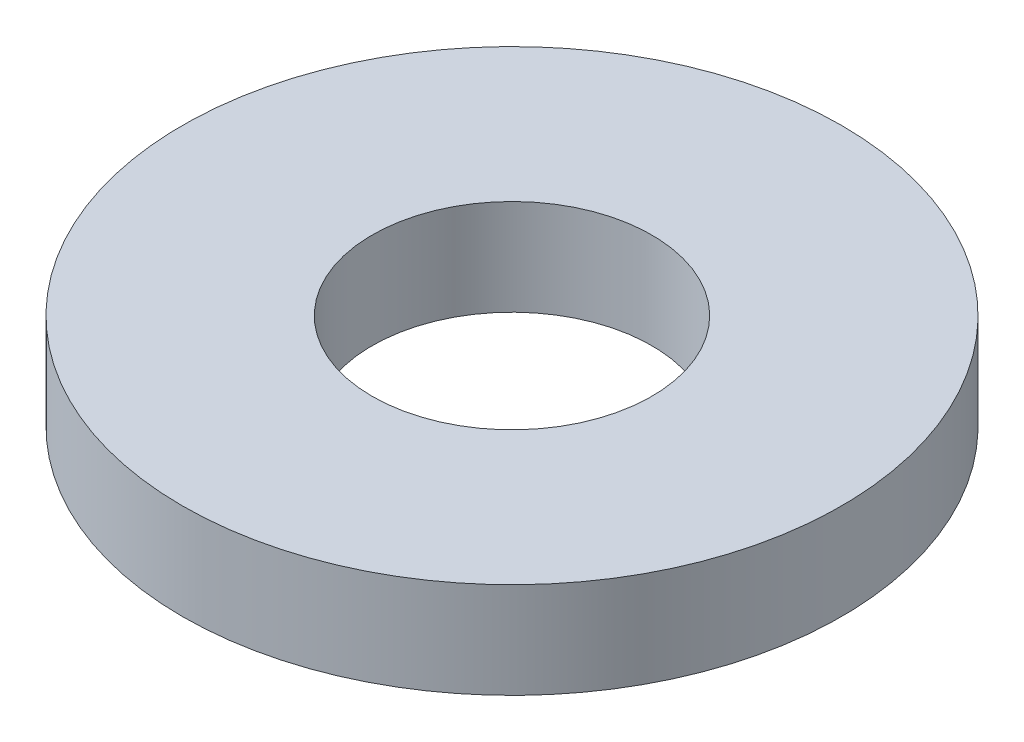
ISO-10303-21;
HEADER;
FILE_DESCRIPTION(('STEP AP214'),'2;1');
FILE_NAME('part.step','',(''),(''),'','','');
FILE_SCHEMA(('AUTOMOTIVE_DESIGN { 1 0 10303 214 1 1 1 1 }'));
ENDSEC;
DATA;
#1=APPLICATION_CONTEXT('core data for automotive mechanical design processes');
#2=APPLICATION_PROTOCOL_DEFINITION('international standard','automotive_design',2000,#1);
#3=PRODUCT_CONTEXT('',#1,'mechanical');
#4=PRODUCT('Part','Part','',(#3));
#5=PRODUCT_RELATED_PRODUCT_CATEGORY('part','',(#4));
#6=PRODUCT_DEFINITION_FORMATION('','',#4);
#7=PRODUCT_DEFINITION_CONTEXT('part definition',#1,'design');
#8=PRODUCT_DEFINITION('design','',#6,#7);
#9=PRODUCT_DEFINITION_SHAPE('','',#8);
#10=(LENGTH_UNIT() NAMED_UNIT(*) SI_UNIT(.MILLI.,.METRE.));
#11=(NAMED_UNIT(*) PLANE_ANGLE_UNIT() SI_UNIT($,.RADIAN.));
#12=(NAMED_UNIT(*) SI_UNIT($,.STERADIAN.) SOLID_ANGLE_UNIT());
#13=UNCERTAINTY_MEASURE_WITH_UNIT(LENGTH_MEASURE(1.E-05),#10,'distance_accuracy_value','');
#14=(GEOMETRIC_REPRESENTATION_CONTEXT(3) GLOBAL_UNCERTAINTY_ASSIGNED_CONTEXT((#13)) GLOBAL_UNIT_ASSIGNED_CONTEXT((#10,
#11,#12)) REPRESENTATION_CONTEXT('',''));
#15=CARTESIAN_POINT('',(0.,0.,0.));
#16=DIRECTION('',(0.,0.,1.));
#17=DIRECTION('',(1.,0.,0.));
#18=AXIS2_PLACEMENT_3D('',#15,#16,#17);
#19=CARTESIAN_POINT('',(0.,24.,0.));
#20=DIRECTION('',(0.,-1.,0.));
#21=DIRECTION('',(0.,0.,-1.));
#22=AXIS2_PLACEMENT_3D('',#19,#20,#21);
#23=CYLINDRICAL_SURFACE('',#22,82.5);
#24=CARTESIAN_POINT('',(0.,24.,0.));
#25=DIRECTION('',(0.,1.,0.));
#26=DIRECTION('',(0.,0.,1.));
#27=AXIS2_PLACEMENT_3D('',#24,#25,#26);
#28=CIRCLE('',#27,82.5);
#29=CARTESIAN_POINT('',(0.,24.,82.5));
#30=VERTEX_POINT('',#29);
#31=EDGE_CURVE('E10',#30,#30,#28,.T.);
#32=ORIENTED_EDGE('',*,*,#31,.F.);
#33=EDGE_LOOP('',(#32));
#34=FACE_BOUND('',#33,.T.);
#35=CARTESIAN_POINT('',(0.,0.,0.));
#36=DIRECTION('',(0.,1.,0.));
#37=DIRECTION('',(0.,0.,1.));
#38=AXIS2_PLACEMENT_3D('',#35,#36,#37);
#39=CIRCLE('',#38,82.5);
#40=CARTESIAN_POINT('',(0.,0.,82.5));
#41=VERTEX_POINT('',#40);
#42=EDGE_CURVE('E37',#41,#41,#39,.T.);
#43=ORIENTED_EDGE('',*,*,#42,.T.);
#44=EDGE_LOOP('',(#43));
#45=FACE_BOUND('',#44,.T.);
#46=ADVANCED_FACE('F40',(#34,#45),#23,.T.);
#47=CARTESIAN_POINT('',(0.,24.,0.));
#48=DIRECTION('',(0.,1.,0.));
#49=DIRECTION('',(0.,0.,1.));
#50=AXIS2_PLACEMENT_3D('',#47,#48,#49);
#51=PLANE('',#50);
#52=CARTESIAN_POINT('',(0.,24.,0.));
#53=DIRECTION('',(0.,1.,0.));
#54=DIRECTION('',(0.,0.,1.));
#55=AXIS2_PLACEMENT_3D('',#52,#53,#54);
#56=CIRCLE('',#55,35.);
#57=CARTESIAN_POINT('',(0.,24.,35.));
#58=VERTEX_POINT('',#57);
#59=EDGE_CURVE('E50',#58,#58,#56,.T.);
#60=ORIENTED_EDGE('',*,*,#59,.F.);
#61=EDGE_LOOP('',(#60));
#62=FACE_BOUND('',#61,.T.);
#63=ORIENTED_EDGE('',*,*,#31,.T.);
#64=EDGE_LOOP('',(#63));
#65=FACE_BOUND('',#64,.T.);
#66=ADVANCED_FACE('F59',(#62,#65),#51,.T.);
#67=CARTESIAN_POINT('',(0.,0.,0.));
#68=DIRECTION('',(0.,1.,0.));
#69=DIRECTION('',(0.,0.,1.));
#70=AXIS2_PLACEMENT_3D('',#67,#68,#69);
#71=PLANE('',#70);
#72=CARTESIAN_POINT('',(0.,0.,0.));
#73=DIRECTION('',(0.,1.,0.));
#74=DIRECTION('',(0.,0.,1.));
#75=AXIS2_PLACEMENT_3D('',#72,#73,#74);
#76=CIRCLE('',#75,35.);
#77=CARTESIAN_POINT('',(0.,0.,35.));
#78=VERTEX_POINT('',#77);
#79=EDGE_CURVE('E47',#78,#78,#76,.T.);
#80=ORIENTED_EDGE('',*,*,#79,.T.);
#81=EDGE_LOOP('',(#80));
#82=FACE_BOUND('',#81,.T.);
#83=ORIENTED_EDGE('',*,*,#42,.F.);
#84=EDGE_LOOP('',(#83));
#85=FACE_BOUND('',#84,.T.);
#86=ADVANCED_FACE('F58',(#82,#85),#71,.F.);
#87=CARTESIAN_POINT('',(0.,24.,0.));
#88=DIRECTION('',(0.,-1.,0.));
#89=DIRECTION('',(0.,0.,-1.));
#90=AXIS2_PLACEMENT_3D('',#87,#88,#89);
#91=CYLINDRICAL_SURFACE('',#90,35.);
#92=ORIENTED_EDGE('',*,*,#59,.T.);
#93=EDGE_LOOP('',(#92));
#94=FACE_BOUND('',#93,.T.);
#95=ORIENTED_EDGE('',*,*,#79,.F.);
#96=EDGE_LOOP('',(#95));
#97=FACE_BOUND('',#96,.T.);
#98=ADVANCED_FACE('F54',(#94,#97),#91,.F.);
#99=CLOSED_SHELL('',(#46,#66,#86,#98));
#100=MANIFOLD_SOLID_BREP('B2',#99);
#101=ADVANCED_BREP_SHAPE_REPRESENTATION('',(#18,#100),#14);
#102=SHAPE_DEFINITION_REPRESENTATION(#9,#101);
ENDSEC;
END-ISO-10303-21;
